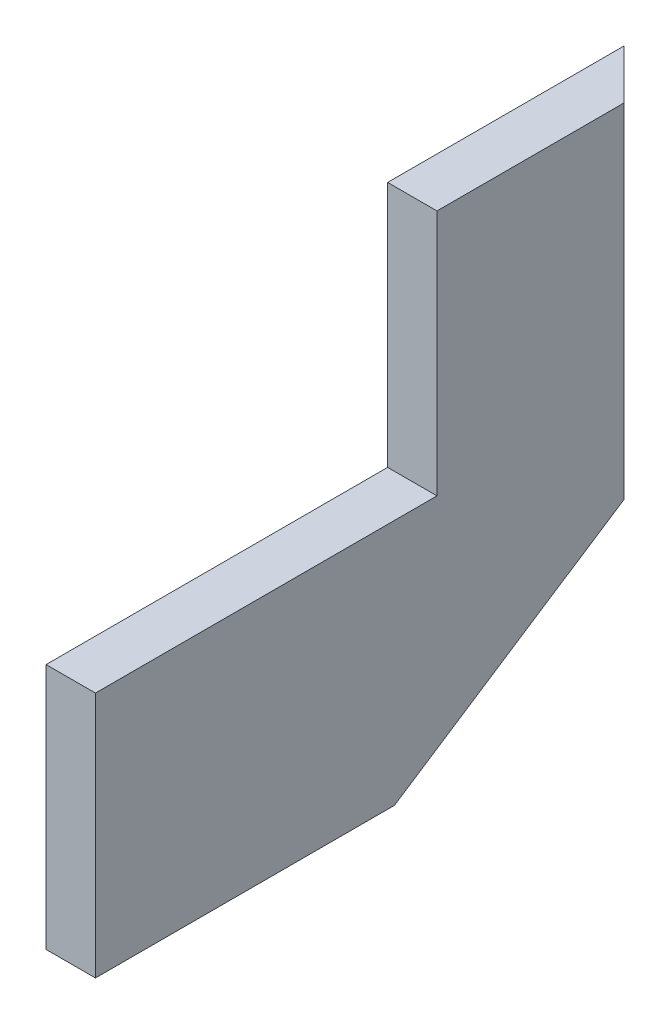
ISO-10303-21;
HEADER;
FILE_DESCRIPTION(('STEP AP214'),'2;1');
FILE_NAME('part.step','',(''),(''),'','','');
FILE_SCHEMA(('AUTOMOTIVE_DESIGN { 1 0 10303 214 1 1 1 1 }'));
ENDSEC;
DATA;
#1=APPLICATION_CONTEXT('core data for automotive mechanical design processes');
#2=APPLICATION_PROTOCOL_DEFINITION('international standard','automotive_design',2000,#1);
#3=PRODUCT_CONTEXT('',#1,'mechanical');
#4=PRODUCT('Part','Part','',(#3));
#5=PRODUCT_RELATED_PRODUCT_CATEGORY('part','',(#4));
#6=PRODUCT_DEFINITION_FORMATION('','',#4);
#7=PRODUCT_DEFINITION_CONTEXT('part definition',#1,'design');
#8=PRODUCT_DEFINITION('design','',#6,#7);
#9=PRODUCT_DEFINITION_SHAPE('','',#8);
#10=(LENGTH_UNIT() NAMED_UNIT(*) SI_UNIT(.MILLI.,.METRE.));
#11=(NAMED_UNIT(*) PLANE_ANGLE_UNIT() SI_UNIT($,.RADIAN.));
#12=(NAMED_UNIT(*) SI_UNIT($,.STERADIAN.) SOLID_ANGLE_UNIT());
#13=UNCERTAINTY_MEASURE_WITH_UNIT(LENGTH_MEASURE(1.E-05),#10,'distance_accuracy_value','');
#14=(GEOMETRIC_REPRESENTATION_CONTEXT(3) GLOBAL_UNCERTAINTY_ASSIGNED_CONTEXT((#13)) GLOBAL_UNIT_ASSIGNED_CONTEXT((#10,
#11,#12)) REPRESENTATION_CONTEXT('',''));
#15=CARTESIAN_POINT('',(0.,0.,0.));
#16=DIRECTION('',(0.,0.,1.));
#17=DIRECTION('',(1.,0.,0.));
#18=AXIS2_PLACEMENT_3D('',#15,#16,#17);
#19=CARTESIAN_POINT('',(38.1,0.,0.));
#20=DIRECTION('',(0.,0.,1.));
#21=DIRECTION('',(1.,0.,0.));
#22=AXIS2_PLACEMENT_3D('',#19,#20,#21);
#23=PLANE('',#22);
#24=DIRECTION('',(0.,1.,0.));
#25=VECTOR('',#24,1.);
#26=CARTESIAN_POINT('',(0.,0.,0.));
#27=LINE('',#26,#25);
#28=CARTESIAN_POINT('',(0.,0.,0.));
#29=VERTEX_POINT('',#28);
#30=CARTESIAN_POINT('',(0.,190.5,0.));
#31=VERTEX_POINT('',#30);
#32=EDGE_CURVE('E118',#29,#31,#27,.T.);
#33=ORIENTED_EDGE('',*,*,#32,.F.);
#34=DIRECTION('',(-1.,0.,0.));
#35=VECTOR('',#34,1.);
#36=CARTESIAN_POINT('',(38.1,0.,0.));
#37=LINE('',#36,#35);
#38=CARTESIAN_POINT('',(38.1,0.,0.));
#39=VERTEX_POINT('',#38);
#40=EDGE_CURVE('E11',#39,#29,#37,.T.);
#41=ORIENTED_EDGE('',*,*,#40,.F.);
#42=DIRECTION('',(0.,1.,0.));
#43=VECTOR('',#42,1.);
#44=CARTESIAN_POINT('',(38.1,0.,0.));
#45=LINE('',#44,#43);
#46=CARTESIAN_POINT('',(38.1,190.5,0.));
#47=VERTEX_POINT('',#46);
#48=EDGE_CURVE('E135',#39,#47,#45,.T.);
#49=ORIENTED_EDGE('',*,*,#48,.T.);
#50=DIRECTION('',(-1.,0.,0.));
#51=VECTOR('',#50,1.);
#52=CARTESIAN_POINT('',(38.1,190.5,0.));
#53=LINE('',#52,#51);
#54=EDGE_CURVE('E51',#47,#31,#53,.T.);
#55=ORIENTED_EDGE('',*,*,#54,.T.);
#56=EDGE_LOOP('',(#33,#41,#49,#55));
#57=FACE_BOUND('',#56,.T.);
#58=ADVANCED_FACE('F35',(#57),#23,.T.);
#59=CARTESIAN_POINT('',(38.1,0.,0.));
#60=DIRECTION('',(0.,1.,0.));
#61=DIRECTION('',(0.,0.,1.));
#62=AXIS2_PLACEMENT_3D('',#59,#60,#61);
#63=PLANE('',#62);
#64=DIRECTION('',(0.,0.,-1.));
#65=VECTOR('',#64,1.);
#66=CARTESIAN_POINT('',(0.,0.,0.));
#67=LINE('',#66,#65);
#68=CARTESIAN_POINT('',(0.,0.,-230.79012683886));
#69=VERTEX_POINT('',#68);
#70=EDGE_CURVE('E120',#29,#69,#67,.T.);
#71=ORIENTED_EDGE('',*,*,#70,.T.);
#72=DIRECTION('',(-1.,0.,0.));
#73=VECTOR('',#72,1.);
#74=CARTESIAN_POINT('',(38.1,0.,-230.79012683886));
#75=LINE('',#74,#73);
#76=CARTESIAN_POINT('',(38.1,0.,-230.79012683886));
#77=VERTEX_POINT('',#76);
#78=EDGE_CURVE('E43',#77,#69,#75,.T.);
#79=ORIENTED_EDGE('',*,*,#78,.F.);
#80=DIRECTION('',(0.,0.,-1.));
#81=VECTOR('',#80,1.);
#82=CARTESIAN_POINT('',(38.1,0.,0.));
#83=LINE('',#82,#81);
#84=EDGE_CURVE('E160',#39,#77,#83,.T.);
#85=ORIENTED_EDGE('',*,*,#84,.F.);
#86=ORIENTED_EDGE('',*,*,#40,.T.);
#87=EDGE_LOOP('',(#71,#79,#85,#86));
#88=FACE_BOUND('',#87,.T.);
#89=ADVANCED_FACE('F162',(#88),#63,.F.);
#90=CARTESIAN_POINT('',(38.1,-105.716899889716,-69.1353861693452));
#91=DIRECTION('',(0.,0.836923205322502,0.547320334349739));
#92=DIRECTION('',(0.,-0.547320334349739,0.836923205322502));
#93=AXIS2_PLACEMENT_3D('',#90,#91,#92);
#94=PLANE('',#93);
#95=DIRECTION('',(0.,0.547320334349739,-0.836923205322502));
#96=VECTOR('',#95,1.);
#97=CARTESIAN_POINT('',(0.,-105.716899889716,-69.1353861693452));
#98=LINE('',#97,#96);
#99=CARTESIAN_POINT('',(0.,140.777827648903,-446.057536726415));
#100=VERTEX_POINT('',#99);
#101=EDGE_CURVE('E123',#69,#100,#98,.T.);
#102=ORIENTED_EDGE('',*,*,#101,.T.);
#103=DIRECTION('',(-0.64180765951058,0.419721165045465,-0.641807659510564));
#104=VECTOR('',#103,1.);
#105=CARTESIAN_POINT('',(37.9230369953384,115.977404914959,-408.134499731077));
#106=LINE('',#105,#104);
#107=CARTESIAN_POINT('',(38.1,115.861676912362,-407.957536726416));
#108=VERTEX_POINT('',#107);
#109=EDGE_CURVE('E121',#108,#100,#106,.T.);
#110=ORIENTED_EDGE('',*,*,#109,.F.);
#111=DIRECTION('',(0.,0.547320334349739,-0.836923205322502));
#112=VECTOR('',#111,1.);
#113=CARTESIAN_POINT('',(38.1,-105.716899889716,-69.1353861693452));
#114=LINE('',#113,#112);
#115=EDGE_CURVE('E110',#77,#108,#114,.T.);
#116=ORIENTED_EDGE('',*,*,#115,.F.);
#117=ORIENTED_EDGE('',*,*,#78,.T.);
#118=EDGE_LOOP('',(#102,#110,#116,#117));
#119=FACE_BOUND('',#118,.T.);
#120=ADVANCED_FACE('F142',(#119),#94,.F.);
#121=CARTESIAN_POINT('',(38.1,381.,0.));
#122=DIRECTION('',(0.,1.,0.));
#123=DIRECTION('',(0.,0.,1.));
#124=AXIS2_PLACEMENT_3D('',#121,#122,#123);
#125=PLANE('',#124);
#126=DIRECTION('',(0.707106781186556,0.,0.707106781186539));
#127=VECTOR('',#126,1.);
#128=CARTESIAN_POINT('',(0.,381.,-446.057536726415));
#129=LINE('',#128,#127);
#130=CARTESIAN_POINT('',(0.,381.,-446.057536726415));
#131=VERTEX_POINT('',#130);
#132=CARTESIAN_POINT('',(38.1,381.,-407.957536726416));
#133=VERTEX_POINT('',#132);
#134=EDGE_CURVE('E153',#131,#133,#129,.T.);
#135=ORIENTED_EDGE('',*,*,#134,.F.);
#136=DIRECTION('',(0.,0.,-1.));
#137=VECTOR('',#136,1.);
#138=CARTESIAN_POINT('',(0.,381.,0.));
#139=LINE('',#138,#137);
#140=CARTESIAN_POINT('',(0.,381.,-263.652));
#141=VERTEX_POINT('',#140);
#142=EDGE_CURVE('E96',#141,#131,#139,.T.);
#143=ORIENTED_EDGE('',*,*,#142,.F.);
#144=DIRECTION('',(-1.,0.,0.));
#145=VECTOR('',#144,1.);
#146=CARTESIAN_POINT('',(38.1,381.,-263.652));
#147=LINE('',#146,#145);
#148=CARTESIAN_POINT('',(38.1,381.,-263.652));
#149=VERTEX_POINT('',#148);
#150=EDGE_CURVE('E89',#149,#141,#147,.T.);
#151=ORIENTED_EDGE('',*,*,#150,.F.);
#152=DIRECTION('',(0.,0.,-1.));
#153=VECTOR('',#152,1.);
#154=CARTESIAN_POINT('',(38.1,381.,0.));
#155=LINE('',#154,#153);
#156=EDGE_CURVE('E94',#149,#133,#155,.T.);
#157=ORIENTED_EDGE('',*,*,#156,.T.);
#158=EDGE_LOOP('',(#135,#143,#151,#157));
#159=FACE_BOUND('',#158,.T.);
#160=ADVANCED_FACE('F92',(#159),#125,.T.);
#161=CARTESIAN_POINT('',(38.1,0.,-263.652));
#162=DIRECTION('',(0.,0.,1.));
#163=DIRECTION('',(1.,0.,0.));
#164=AXIS2_PLACEMENT_3D('',#161,#162,#163);
#165=PLANE('',#164);
#166=DIRECTION('',(0.,1.,0.));
#167=VECTOR('',#166,1.);
#168=CARTESIAN_POINT('',(0.,0.,-263.652));
#169=LINE('',#168,#167);
#170=CARTESIAN_POINT('',(0.,190.5,-263.652));
#171=VERTEX_POINT('',#170);
#172=EDGE_CURVE('E130',#171,#141,#169,.T.);
#173=ORIENTED_EDGE('',*,*,#172,.F.);
#174=DIRECTION('',(-1.,0.,0.));
#175=VECTOR('',#174,1.);
#176=CARTESIAN_POINT('',(38.1,190.5,-263.652));
#177=LINE('',#176,#175);
#178=CARTESIAN_POINT('',(38.1,190.5,-263.652));
#179=VERTEX_POINT('',#178);
#180=EDGE_CURVE('E71',#179,#171,#177,.T.);
#181=ORIENTED_EDGE('',*,*,#180,.F.);
#182=DIRECTION('',(0.,1.,0.));
#183=VECTOR('',#182,1.);
#184=CARTESIAN_POINT('',(38.1,0.,-263.652));
#185=LINE('',#184,#183);
#186=EDGE_CURVE('E106',#179,#149,#185,.T.);
#187=ORIENTED_EDGE('',*,*,#186,.T.);
#188=ORIENTED_EDGE('',*,*,#150,.T.);
#189=EDGE_LOOP('',(#173,#181,#187,#188));
#190=FACE_BOUND('',#189,.T.);
#191=ADVANCED_FACE('F112',(#190),#165,.T.);
#192=CARTESIAN_POINT('',(38.1,190.5,0.));
#193=DIRECTION('',(0.,1.,0.));
#194=DIRECTION('',(0.,0.,1.));
#195=AXIS2_PLACEMENT_3D('',#192,#193,#194);
#196=PLANE('',#195);
#197=DIRECTION('',(0.,0.,-1.));
#198=VECTOR('',#197,1.);
#199=CARTESIAN_POINT('',(0.,190.5,0.));
#200=LINE('',#199,#198);
#201=EDGE_CURVE('E132',#31,#171,#200,.T.);
#202=ORIENTED_EDGE('',*,*,#201,.F.);
#203=ORIENTED_EDGE('',*,*,#54,.F.);
#204=DIRECTION('',(0.,0.,-1.));
#205=VECTOR('',#204,1.);
#206=CARTESIAN_POINT('',(38.1,190.5,0.));
#207=LINE('',#206,#205);
#208=EDGE_CURVE('E113',#47,#179,#207,.T.);
#209=ORIENTED_EDGE('',*,*,#208,.T.);
#210=ORIENTED_EDGE('',*,*,#180,.T.);
#211=EDGE_LOOP('',(#202,#203,#209,#210));
#212=FACE_BOUND('',#211,.T.);
#213=ADVANCED_FACE('F174',(#212),#196,.T.);
#214=CARTESIAN_POINT('',(38.1,0.,0.));
#215=DIRECTION('',(1.,0.,0.));
#216=DIRECTION('',(0.,0.,-1.));
#217=AXIS2_PLACEMENT_3D('',#214,#215,#216);
#218=PLANE('',#217);
#219=DIRECTION('',(0.,1.,0.));
#220=VECTOR('',#219,1.);
#221=CARTESIAN_POINT('',(38.1,-0.00100000000002876,-407.957536726416));
#222=LINE('',#221,#220);
#223=EDGE_CURVE('E109',#108,#133,#222,.T.);
#224=ORIENTED_EDGE('',*,*,#223,.T.);
#225=ORIENTED_EDGE('',*,*,#156,.F.);
#226=ORIENTED_EDGE('',*,*,#186,.F.);
#227=ORIENTED_EDGE('',*,*,#208,.F.);
#228=ORIENTED_EDGE('',*,*,#48,.F.);
#229=ORIENTED_EDGE('',*,*,#84,.T.);
#230=ORIENTED_EDGE('',*,*,#115,.T.);
#231=EDGE_LOOP('',(#224,#225,#226,#227,#228,#229,#230));
#232=FACE_BOUND('',#231,.T.);
#233=ADVANCED_FACE('F104',(#232),#218,.T.);
#234=CARTESIAN_POINT('',(0.,0.,0.));
#235=DIRECTION('',(1.,0.,0.));
#236=DIRECTION('',(0.,0.,-1.));
#237=AXIS2_PLACEMENT_3D('',#234,#235,#236);
#238=PLANE('',#237);
#239=ORIENTED_EDGE('',*,*,#32,.T.);
#240=ORIENTED_EDGE('',*,*,#201,.T.);
#241=ORIENTED_EDGE('',*,*,#172,.T.);
#242=ORIENTED_EDGE('',*,*,#142,.T.);
#243=DIRECTION('',(0.,-1.,0.));
#244=VECTOR('',#243,1.);
#245=CARTESIAN_POINT('',(0.,1.03076111321118E-13,-446.057536726415));
#246=LINE('',#245,#244);
#247=EDGE_CURVE('E126',#131,#100,#246,.T.);
#248=ORIENTED_EDGE('',*,*,#247,.T.);
#249=ORIENTED_EDGE('',*,*,#101,.F.);
#250=ORIENTED_EDGE('',*,*,#70,.F.);
#251=EDGE_LOOP('',(#239,#240,#241,#242,#248,#249,#250));
#252=FACE_BOUND('',#251,.T.);
#253=ADVANCED_FACE('F147',(#252),#238,.F.);
#254=CARTESIAN_POINT('',(0.,-0.00100000000002876,-446.057536726415));
#255=DIRECTION('',(-0.707106781186539,0.,0.707106781186556));
#256=DIRECTION('',(0.707106781186556,0.,0.707106781186539));
#257=AXIS2_PLACEMENT_3D('',#254,#255,#256);
#258=PLANE('',#257);
#259=ORIENTED_EDGE('',*,*,#109,.T.);
#260=ORIENTED_EDGE('',*,*,#247,.F.);
#261=ORIENTED_EDGE('',*,*,#134,.T.);
#262=ORIENTED_EDGE('',*,*,#223,.F.);
#263=EDGE_LOOP('',(#259,#260,#261,#262));
#264=FACE_BOUND('',#263,.T.);
#265=ADVANCED_FACE('F152',(#264),#258,.F.);
#266=CLOSED_SHELL('',(#58,#89,#120,#160,#191,#213,#233,#253,#265));
#267=MANIFOLD_SOLID_BREP('B2',#266);
#268=ADVANCED_BREP_SHAPE_REPRESENTATION('',(#18,#267),#14);
#269=SHAPE_DEFINITION_REPRESENTATION(#9,#268);
ENDSEC;
END-ISO-10303-21;
